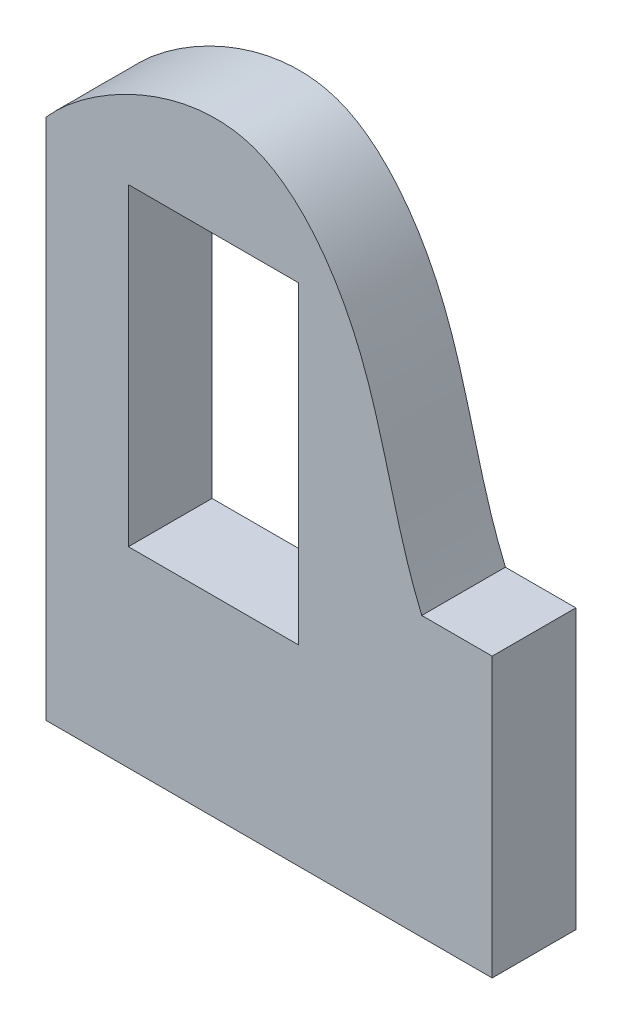
ISO-10303-21;
HEADER;
FILE_DESCRIPTION(('STEP AP214'),'2;1');
FILE_NAME('part.step','',(''),(''),'','','');
FILE_SCHEMA(('AUTOMOTIVE_DESIGN { 1 0 10303 214 1 1 1 1 }'));
ENDSEC;
DATA;
#1=APPLICATION_CONTEXT('core data for automotive mechanical design processes');
#2=APPLICATION_PROTOCOL_DEFINITION('international standard','automotive_design',2000,#1);
#3=PRODUCT_CONTEXT('',#1,'mechanical');
#4=PRODUCT('Part','Part','',(#3));
#5=PRODUCT_RELATED_PRODUCT_CATEGORY('part','',(#4));
#6=PRODUCT_DEFINITION_FORMATION('','',#4);
#7=PRODUCT_DEFINITION_CONTEXT('part definition',#1,'design');
#8=PRODUCT_DEFINITION('design','',#6,#7);
#9=PRODUCT_DEFINITION_SHAPE('','',#8);
#10=(LENGTH_UNIT() NAMED_UNIT(*) SI_UNIT(.MILLI.,.METRE.));
#11=(NAMED_UNIT(*) PLANE_ANGLE_UNIT() SI_UNIT($,.RADIAN.));
#12=(NAMED_UNIT(*) SI_UNIT($,.STERADIAN.) SOLID_ANGLE_UNIT());
#13=UNCERTAINTY_MEASURE_WITH_UNIT(LENGTH_MEASURE(1.E-05),#10,'distance_accuracy_value','');
#14=(GEOMETRIC_REPRESENTATION_CONTEXT(3) GLOBAL_UNCERTAINTY_ASSIGNED_CONTEXT((#13)) GLOBAL_UNIT_ASSIGNED_CONTEXT((#10,
#11,#12)) REPRESENTATION_CONTEXT('',''));
#15=CARTESIAN_POINT('',(0.,0.,0.));
#16=DIRECTION('',(0.,0.,1.));
#17=DIRECTION('',(1.,0.,0.));
#18=AXIS2_PLACEMENT_3D('',#15,#16,#17);
#19=CARTESIAN_POINT('',(-32.,55.,12.));
#20=CARTESIAN_POINT('',(-26.0930970909908,61.8283078861157,12.));
#21=CARTESIAN_POINT('',(-5.10331489157279,73.642536113921,12.));
#22=CARTESIAN_POINT('',(16.0622134358606,49.1006601730347,12.));
#23=CARTESIAN_POINT('',(17.0609084080481,31.4034927897983,12.));
#24=CARTESIAN_POINT('',(21.8947368421052,20.,12.));
#25=B_SPLINE_CURVE_WITH_KNOTS('',3,(#19,#20,#21,#22,#23,#24),.UNSPECIFIED.,.F.,.F.,(4,1,1,4),
(0.,0.381160140731794,0.579099431730259,1.),.UNSPECIFIED.);
#26=DIRECTION('',(0.,0.,-1.));
#27=VECTOR('',#26,1.);
#28=SURFACE_OF_LINEAR_EXTRUSION('',#25,#27);
#29=CARTESIAN_POINT('',(-32.,55.,0.));
#30=CARTESIAN_POINT('',(-26.0930970909908,61.8283078861157,0.));
#31=CARTESIAN_POINT('',(-5.10331489157279,73.642536113921,0.));
#32=CARTESIAN_POINT('',(16.0622134358606,49.1006601730347,0.));
#33=CARTESIAN_POINT('',(17.0609084080481,31.4034927897983,0.));
#34=CARTESIAN_POINT('',(21.8947368421052,20.,0.));
#35=B_SPLINE_CURVE_WITH_KNOTS('',3,(#29,#30,#31,#32,#33,#34),.UNSPECIFIED.,.F.,.F.,(4,1,1,4),
(0.,0.381160140731794,0.579099431730259,1.),.UNSPECIFIED.);
#36=CARTESIAN_POINT('',(-32.,55.,0.));
#37=VERTEX_POINT('',#36);
#38=CARTESIAN_POINT('',(21.8947368421052,20.,0.));
#39=VERTEX_POINT('',#38);
#40=EDGE_CURVE('E150',#37,#39,#35,.T.);
#41=ORIENTED_EDGE('',*,*,#40,.F.);
#42=DIRECTION('',(0.,0.,-1.));
#43=VECTOR('',#42,1.);
#44=CARTESIAN_POINT('',(-32.,55.,12.));
#45=LINE('',#44,#43);
#46=CARTESIAN_POINT('',(-32.,55.,12.));
#47=VERTEX_POINT('',#46);
#48=EDGE_CURVE('E214',#47,#37,#45,.T.);
#49=ORIENTED_EDGE('',*,*,#48,.F.);
#50=CARTESIAN_POINT('',(21.8947368421052,20.,12.));
#51=VERTEX_POINT('',#50);
#52=EDGE_CURVE('E154',#47,#51,#25,.T.);
#53=ORIENTED_EDGE('',*,*,#52,.T.);
#54=DIRECTION('',(0.,0.,-1.));
#55=VECTOR('',#54,1.);
#56=CARTESIAN_POINT('',(21.8947368421052,20.,12.));
#57=LINE('',#56,#55);
#58=EDGE_CURVE('E179',#51,#39,#57,.T.);
#59=ORIENTED_EDGE('',*,*,#58,.T.);
#60=EDGE_LOOP('',(#41,#49,#53,#59));
#61=FACE_BOUND('',#60,.T.);
#62=ADVANCED_FACE('F47',(#61),#28,.T.);
#63=CARTESIAN_POINT('',(-32.,0.,12.));
#64=DIRECTION('',(-1.,0.,0.));
#65=DIRECTION('',(0.,0.,1.));
#66=AXIS2_PLACEMENT_3D('',#63,#64,#65);
#67=PLANE('',#66);
#68=DIRECTION('',(0.,1.,0.));
#69=VECTOR('',#68,1.);
#70=CARTESIAN_POINT('',(-32.,0.,0.));
#71=LINE('',#70,#69);
#72=CARTESIAN_POINT('',(-32.,-20.,0.));
#73=VERTEX_POINT('',#72);
#74=EDGE_CURVE('E185',#73,#37,#71,.T.);
#75=ORIENTED_EDGE('',*,*,#74,.F.);
#76=DIRECTION('',(0.,0.,-1.));
#77=VECTOR('',#76,1.);
#78=CARTESIAN_POINT('',(-32.,-20.,12.));
#79=LINE('',#78,#77);
#80=CARTESIAN_POINT('',(-32.,-20.,12.));
#81=VERTEX_POINT('',#80);
#82=EDGE_CURVE('E211',#81,#73,#79,.T.);
#83=ORIENTED_EDGE('',*,*,#82,.F.);
#84=DIRECTION('',(0.,1.,0.));
#85=VECTOR('',#84,1.);
#86=CARTESIAN_POINT('',(-32.,0.,12.));
#87=LINE('',#86,#85);
#88=EDGE_CURVE('E161',#81,#47,#87,.T.);
#89=ORIENTED_EDGE('',*,*,#88,.T.);
#90=ORIENTED_EDGE('',*,*,#48,.T.);
#91=EDGE_LOOP('',(#75,#83,#89,#90));
#92=FACE_BOUND('',#91,.T.);
#93=ADVANCED_FACE('F241',(#92),#67,.T.);
#94=CARTESIAN_POINT('',(0.,-20.,12.));
#95=DIRECTION('',(0.,1.,0.));
#96=DIRECTION('',(-1.,0.,0.));
#97=AXIS2_PLACEMENT_3D('',#94,#95,#96);
#98=PLANE('',#97);
#99=DIRECTION('',(1.,0.,0.));
#100=VECTOR('',#99,1.);
#101=CARTESIAN_POINT('',(0.,-20.,0.));
#102=LINE('',#101,#100);
#103=CARTESIAN_POINT('',(32.,-20.,0.));
#104=VERTEX_POINT('',#103);
#105=EDGE_CURVE('E192',#73,#104,#102,.T.);
#106=ORIENTED_EDGE('',*,*,#105,.T.);
#107=DIRECTION('',(0.,0.,-1.));
#108=VECTOR('',#107,1.);
#109=CARTESIAN_POINT('',(32.,-20.,12.));
#110=LINE('',#109,#108);
#111=CARTESIAN_POINT('',(32.,-20.,12.));
#112=VERTEX_POINT('',#111);
#113=EDGE_CURVE('E207',#112,#104,#110,.T.);
#114=ORIENTED_EDGE('',*,*,#113,.F.);
#115=DIRECTION('',(1.,0.,0.));
#116=VECTOR('',#115,1.);
#117=CARTESIAN_POINT('',(0.,-20.,12.));
#118=LINE('',#117,#116);
#119=EDGE_CURVE('E169',#81,#112,#118,.T.);
#120=ORIENTED_EDGE('',*,*,#119,.F.);
#121=ORIENTED_EDGE('',*,*,#82,.T.);
#122=EDGE_LOOP('',(#106,#114,#120,#121));
#123=FACE_BOUND('',#122,.T.);
#124=ADVANCED_FACE('F246',(#123),#98,.F.);
#125=CARTESIAN_POINT('',(32.,0.,12.));
#126=DIRECTION('',(-1.,0.,0.));
#127=DIRECTION('',(0.,0.,1.));
#128=AXIS2_PLACEMENT_3D('',#125,#126,#127);
#129=PLANE('',#128);
#130=DIRECTION('',(0.,1.,0.));
#131=VECTOR('',#130,1.);
#132=CARTESIAN_POINT('',(32.,0.,0.));
#133=LINE('',#132,#131);
#134=CARTESIAN_POINT('',(32.,20.,0.));
#135=VERTEX_POINT('',#134);
#136=EDGE_CURVE('E195',#104,#135,#133,.T.);
#137=ORIENTED_EDGE('',*,*,#136,.T.);
#138=DIRECTION('',(0.,0.,-1.));
#139=VECTOR('',#138,1.);
#140=CARTESIAN_POINT('',(32.,20.,12.));
#141=LINE('',#140,#139);
#142=CARTESIAN_POINT('',(32.,20.,12.));
#143=VERTEX_POINT('',#142);
#144=EDGE_CURVE('E204',#143,#135,#141,.T.);
#145=ORIENTED_EDGE('',*,*,#144,.F.);
#146=DIRECTION('',(0.,1.,0.));
#147=VECTOR('',#146,1.);
#148=CARTESIAN_POINT('',(32.,0.,12.));
#149=LINE('',#148,#147);
#150=EDGE_CURVE('E172',#112,#143,#149,.T.);
#151=ORIENTED_EDGE('',*,*,#150,.F.);
#152=ORIENTED_EDGE('',*,*,#113,.T.);
#153=EDGE_LOOP('',(#137,#145,#151,#152));
#154=FACE_BOUND('',#153,.T.);
#155=ADVANCED_FACE('F263',(#154),#129,.F.);
#156=CARTESIAN_POINT('',(0.,20.,12.));
#157=DIRECTION('',(0.,1.,0.));
#158=DIRECTION('',(0.,0.,1.));
#159=AXIS2_PLACEMENT_3D('',#156,#157,#158);
#160=PLANE('',#159);
#161=DIRECTION('',(1.,0.,0.));
#162=VECTOR('',#161,1.);
#163=CARTESIAN_POINT('',(0.,20.,0.));
#164=LINE('',#163,#162);
#165=EDGE_CURVE('E162',#39,#135,#164,.T.);
#166=ORIENTED_EDGE('',*,*,#165,.F.);
#167=ORIENTED_EDGE('',*,*,#58,.F.);
#168=DIRECTION('',(1.,0.,0.));
#169=VECTOR('',#168,1.);
#170=CARTESIAN_POINT('',(0.,20.,12.));
#171=LINE('',#170,#169);
#172=EDGE_CURVE('E175',#51,#143,#171,.T.);
#173=ORIENTED_EDGE('',*,*,#172,.T.);
#174=ORIENTED_EDGE('',*,*,#144,.T.);
#175=EDGE_LOOP('',(#166,#167,#173,#174));
#176=FACE_BOUND('',#175,.T.);
#177=ADVANCED_FACE('F261',(#176),#160,.T.);
#178=CARTESIAN_POINT('',(0.,0.,12.));
#179=DIRECTION('',(0.,0.,1.));
#180=DIRECTION('',(1.,0.,0.));
#181=AXIS2_PLACEMENT_3D('',#178,#179,#180);
#182=PLANE('',#181);
#183=DIRECTION('',(0.,-1.,0.));
#184=VECTOR('',#183,1.);
#185=CARTESIAN_POINT('',(-20.2,52.5,12.));
#186=LINE('',#185,#184);
#187=CARTESIAN_POINT('',(-20.2,52.5,12.));
#188=VERTEX_POINT('',#187);
#189=CARTESIAN_POINT('',(-20.2,7.49999999999999,12.));
#190=VERTEX_POINT('',#189);
#191=EDGE_CURVE('E63',#188,#190,#186,.T.);
#192=ORIENTED_EDGE('',*,*,#191,.F.);
#193=DIRECTION('',(-1.,0.,0.));
#194=VECTOR('',#193,1.);
#195=CARTESIAN_POINT('',(4.19999999999998,52.5,12.));
#196=LINE('',#195,#194);
#197=CARTESIAN_POINT('',(4.19999999999998,52.5,12.));
#198=VERTEX_POINT('',#197);
#199=EDGE_CURVE('E140',#198,#188,#196,.T.);
#200=ORIENTED_EDGE('',*,*,#199,.F.);
#201=DIRECTION('',(0.,1.,0.));
#202=VECTOR('',#201,1.);
#203=CARTESIAN_POINT('',(4.19999999999998,52.5,12.));
#204=LINE('',#203,#202);
#205=CARTESIAN_POINT('',(4.20000000000002,7.5,12.));
#206=VERTEX_POINT('',#205);
#207=EDGE_CURVE('E122',#206,#198,#204,.T.);
#208=ORIENTED_EDGE('',*,*,#207,.F.);
#209=DIRECTION('',(1.,0.,0.));
#210=VECTOR('',#209,1.);
#211=CARTESIAN_POINT('',(4.20000000000002,7.5,12.));
#212=LINE('',#211,#210);
#213=EDGE_CURVE('E132',#190,#206,#212,.T.);
#214=ORIENTED_EDGE('',*,*,#213,.F.);
#215=EDGE_LOOP('',(#192,#200,#208,#214));
#216=FACE_BOUND('',#215,.T.);
#217=ORIENTED_EDGE('',*,*,#52,.F.);
#218=ORIENTED_EDGE('',*,*,#88,.F.);
#219=ORIENTED_EDGE('',*,*,#119,.T.);
#220=ORIENTED_EDGE('',*,*,#150,.T.);
#221=ORIENTED_EDGE('',*,*,#172,.F.);
#222=EDGE_LOOP('',(#217,#218,#219,#220,#221));
#223=FACE_BOUND('',#222,.T.);
#224=ADVANCED_FACE('F137',(#216,#223),#182,.T.);
#225=CARTESIAN_POINT('',(0.,0.,0.));
#226=DIRECTION('',(0.,0.,1.));
#227=DIRECTION('',(1.,0.,0.));
#228=AXIS2_PLACEMENT_3D('',#225,#226,#227);
#229=PLANE('',#228);
#230=DIRECTION('',(-1.,0.,0.));
#231=VECTOR('',#230,1.);
#232=CARTESIAN_POINT('',(0.,52.5,0.));
#233=LINE('',#232,#231);
#234=CARTESIAN_POINT('',(4.19999999999998,52.5,0.));
#235=VERTEX_POINT('',#234);
#236=CARTESIAN_POINT('',(-20.2,52.5,0.));
#237=VERTEX_POINT('',#236);
#238=EDGE_CURVE('E56',#235,#237,#233,.T.);
#239=ORIENTED_EDGE('',*,*,#238,.T.);
#240=DIRECTION('',(0.,-1.,0.));
#241=VECTOR('',#240,1.);
#242=CARTESIAN_POINT('',(-20.2,0.,0.));
#243=LINE('',#242,#241);
#244=CARTESIAN_POINT('',(-20.2,7.49999999999999,0.));
#245=VERTEX_POINT('',#244);
#246=EDGE_CURVE('E11',#237,#245,#243,.T.);
#247=ORIENTED_EDGE('',*,*,#246,.T.);
#248=DIRECTION('',(1.,0.,0.));
#249=VECTOR('',#248,1.);
#250=CARTESIAN_POINT('',(0.,7.5,0.));
#251=LINE('',#250,#249);
#252=CARTESIAN_POINT('',(4.20000000000002,7.5,0.));
#253=VERTEX_POINT('',#252);
#254=EDGE_CURVE('E217',#245,#253,#251,.T.);
#255=ORIENTED_EDGE('',*,*,#254,.T.);
#256=DIRECTION('',(0.,1.,0.));
#257=VECTOR('',#256,1.);
#258=CARTESIAN_POINT('',(4.20000000000003,0.,0.));
#259=LINE('',#258,#257);
#260=EDGE_CURVE('E125',#253,#235,#259,.T.);
#261=ORIENTED_EDGE('',*,*,#260,.T.);
#262=EDGE_LOOP('',(#239,#247,#255,#261));
#263=FACE_BOUND('',#262,.T.);
#264=ORIENTED_EDGE('',*,*,#40,.T.);
#265=ORIENTED_EDGE('',*,*,#165,.T.);
#266=ORIENTED_EDGE('',*,*,#136,.F.);
#267=ORIENTED_EDGE('',*,*,#105,.F.);
#268=ORIENTED_EDGE('',*,*,#74,.T.);
#269=EDGE_LOOP('',(#264,#265,#266,#267,#268));
#270=FACE_BOUND('',#269,.T.);
#271=ADVANCED_FACE('F224',(#263,#270),#229,.F.);
#272=CARTESIAN_POINT('',(-20.2,52.5,-8.));
#273=DIRECTION('',(-1.,0.,0.));
#274=DIRECTION('',(0.,-1.,0.));
#275=AXIS2_PLACEMENT_3D('',#272,#273,#274);
#276=PLANE('',#275);
#277=DIRECTION('',(0.,0.,1.));
#278=VECTOR('',#277,1.);
#279=CARTESIAN_POINT('',(-20.2,52.5,-8.));
#280=LINE('',#279,#278);
#281=EDGE_CURVE('E147',#237,#188,#280,.T.);
#282=ORIENTED_EDGE('',*,*,#281,.T.);
#283=ORIENTED_EDGE('',*,*,#191,.T.);
#284=DIRECTION('',(0.,0.,1.));
#285=VECTOR('',#284,1.);
#286=CARTESIAN_POINT('',(-20.2,7.49999999999999,-8.));
#287=LINE('',#286,#285);
#288=EDGE_CURVE('E129',#245,#190,#287,.T.);
#289=ORIENTED_EDGE('',*,*,#288,.F.);
#290=ORIENTED_EDGE('',*,*,#246,.F.);
#291=EDGE_LOOP('',(#282,#283,#289,#290));
#292=FACE_BOUND('',#291,.T.);
#293=ADVANCED_FACE('F229',(#292),#276,.F.);
#294=CARTESIAN_POINT('',(4.19999999999998,52.5,-8.));
#295=DIRECTION('',(0.,1.,0.));
#296=DIRECTION('',(-1.,0.,0.));
#297=AXIS2_PLACEMENT_3D('',#294,#295,#296);
#298=PLANE('',#297);
#299=DIRECTION('',(0.,0.,1.));
#300=VECTOR('',#299,1.);
#301=CARTESIAN_POINT('',(4.19999999999998,52.5,-8.));
#302=LINE('',#301,#300);
#303=EDGE_CURVE('E128',#235,#198,#302,.T.);
#304=ORIENTED_EDGE('',*,*,#303,.T.);
#305=ORIENTED_EDGE('',*,*,#199,.T.);
#306=ORIENTED_EDGE('',*,*,#281,.F.);
#307=ORIENTED_EDGE('',*,*,#238,.F.);
#308=EDGE_LOOP('',(#304,#305,#306,#307));
#309=FACE_BOUND('',#308,.T.);
#310=ADVANCED_FACE('F228',(#309),#298,.F.);
#311=CARTESIAN_POINT('',(4.19999999999998,52.5,-8.));
#312=DIRECTION('',(1.,0.,0.));
#313=DIRECTION('',(0.,1.,0.));
#314=AXIS2_PLACEMENT_3D('',#311,#312,#313);
#315=PLANE('',#314);
#316=DIRECTION('',(0.,0.,1.));
#317=VECTOR('',#316,1.);
#318=CARTESIAN_POINT('',(4.20000000000002,7.5,-8.));
#319=LINE('',#318,#317);
#320=EDGE_CURVE('E71',#253,#206,#319,.T.);
#321=ORIENTED_EDGE('',*,*,#320,.T.);
#322=ORIENTED_EDGE('',*,*,#207,.T.);
#323=ORIENTED_EDGE('',*,*,#303,.F.);
#324=ORIENTED_EDGE('',*,*,#260,.F.);
#325=EDGE_LOOP('',(#321,#322,#323,#324));
#326=FACE_BOUND('',#325,.T.);
#327=ADVANCED_FACE('F119',(#326),#315,.F.);
#328=CARTESIAN_POINT('',(4.20000000000002,7.5,-8.));
#329=DIRECTION('',(0.,-1.,0.));
#330=DIRECTION('',(1.,0.,0.));
#331=AXIS2_PLACEMENT_3D('',#328,#329,#330);
#332=PLANE('',#331);
#333=ORIENTED_EDGE('',*,*,#288,.T.);
#334=ORIENTED_EDGE('',*,*,#213,.T.);
#335=ORIENTED_EDGE('',*,*,#320,.F.);
#336=ORIENTED_EDGE('',*,*,#254,.F.);
#337=EDGE_LOOP('',(#333,#334,#335,#336));
#338=FACE_BOUND('',#337,.T.);
#339=ADVANCED_FACE('F133',(#338),#332,.F.);
#340=CLOSED_SHELL('',(#62,#93,#124,#155,#177,#224,#271,#293,#310,#327,#339));
#341=MANIFOLD_SOLID_BREP('B2',#340);
#342=ADVANCED_BREP_SHAPE_REPRESENTATION('',(#18,#341),#14);
#343=SHAPE_DEFINITION_REPRESENTATION(#9,#342);
ENDSEC;
END-ISO-10303-21;
